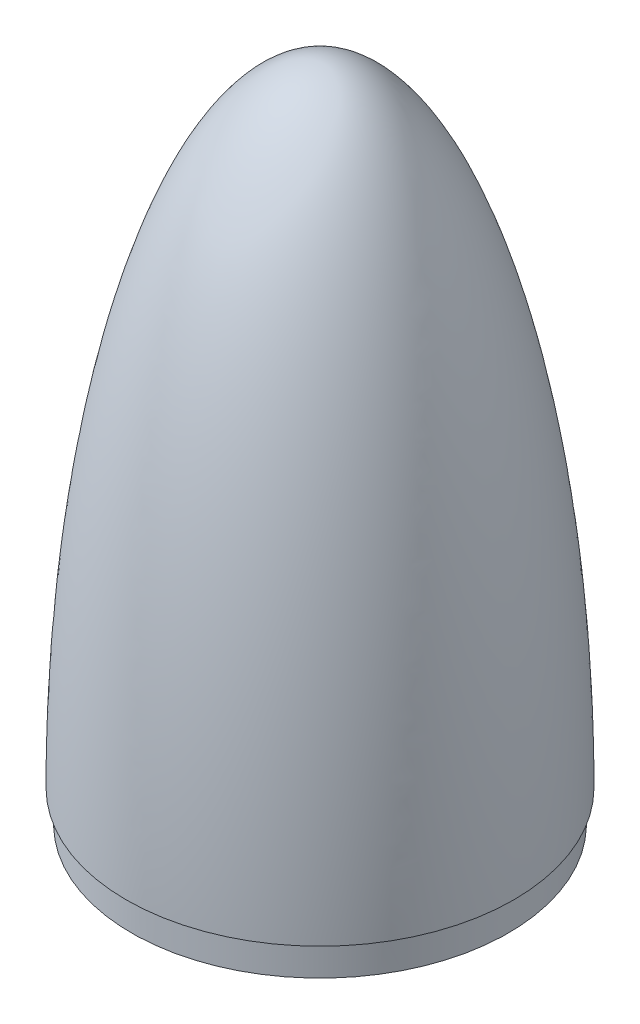
ISO-10303-21;
HEADER;
FILE_DESCRIPTION(('STEP AP214'),'2;1');
FILE_NAME('part.step','',(''),(''),'','','');
FILE_SCHEMA(('AUTOMOTIVE_DESIGN { 1 0 10303 214 1 1 1 1 }'));
ENDSEC;
DATA;
#1=APPLICATION_CONTEXT('core data for automotive mechanical design processes');
#2=APPLICATION_PROTOCOL_DEFINITION('international standard','automotive_design',2000,#1);
#3=PRODUCT_CONTEXT('',#1,'mechanical');
#4=PRODUCT('Part','Part','',(#3));
#5=PRODUCT_RELATED_PRODUCT_CATEGORY('part','',(#4));
#6=PRODUCT_DEFINITION_FORMATION('','',#4);
#7=PRODUCT_DEFINITION_CONTEXT('part definition',#1,'design');
#8=PRODUCT_DEFINITION('design','',#6,#7);
#9=PRODUCT_DEFINITION_SHAPE('','',#8);
#10=(LENGTH_UNIT() NAMED_UNIT(*) SI_UNIT(.MILLI.,.METRE.));
#11=(NAMED_UNIT(*) PLANE_ANGLE_UNIT() SI_UNIT($,.RADIAN.));
#12=(NAMED_UNIT(*) SI_UNIT($,.STERADIAN.) SOLID_ANGLE_UNIT());
#13=UNCERTAINTY_MEASURE_WITH_UNIT(LENGTH_MEASURE(1.E-05),#10,'distance_accuracy_value','');
#14=(GEOMETRIC_REPRESENTATION_CONTEXT(3) GLOBAL_UNCERTAINTY_ASSIGNED_CONTEXT((#13)) GLOBAL_UNIT_ASSIGNED_CONTEXT((#10,
#11,#12)) REPRESENTATION_CONTEXT('',''));
#15=CARTESIAN_POINT('',(0.,0.,0.));
#16=DIRECTION('',(0.,0.,1.));
#17=DIRECTION('',(1.,0.,0.));
#18=AXIS2_PLACEMENT_3D('',#15,#16,#17);
#19=CARTESIAN_POINT('',(5.35625942877467E-13,254.002000000112,0.));
#20=DIRECTION('',(0.,-1.,0.));
#21=DIRECTION('',(0.,0.,-1.));
#22=AXIS2_PLACEMENT_3D('',#19,#20,#21);
#23=CYLINDRICAL_SURFACE('',#22,12.6999999999741);
#24=CARTESIAN_POINT('',(5.35625942877467E-13,225.679493583166,0.));
#25=DIRECTION('',(0.,-1.,0.));
#26=DIRECTION('',(1.,0.,0.));
#27=AXIS2_PLACEMENT_3D('',#24,#25,#26);
#28=CIRCLE('',#27,12.6999999999741);
#29=CARTESIAN_POINT('',(12.6999999999747,225.679493583166,0.));
#30=VERTEX_POINT('',#29);
#31=EDGE_CURVE('E55',#30,#30,#28,.T.);
#32=ORIENTED_EDGE('',*,*,#31,.T.);
#33=EDGE_LOOP('',(#32));
#34=FACE_BOUND('',#33,.T.);
#35=CARTESIAN_POINT('',(5.35625942877467E-13,7.61999999999999,0.));
#36=DIRECTION('',(0.,-1.,0.));
#37=DIRECTION('',(0.,0.,-1.));
#38=AXIS2_PLACEMENT_3D('',#35,#36,#37);
#39=CIRCLE('',#38,12.6999999999741);
#40=CARTESIAN_POINT('',(5.35625942877467E-13,7.61999999999999,-12.6999999999741));
#41=VERTEX_POINT('',#40);
#42=EDGE_CURVE('E97',#41,#41,#39,.F.);
#43=ORIENTED_EDGE('',*,*,#42,.T.);
#44=EDGE_LOOP('',(#43));
#45=FACE_BOUND('',#44,.T.);
#46=ADVANCED_FACE('F46',(#34,#45),#23,.T.);
#47=CARTESIAN_POINT('',(0.,0.,0.));
#48=DIRECTION('',(0.,-1.,0.));
#49=DIRECTION('',(0.,0.,-1.));
#50=AXIS2_PLACEMENT_3D('',#47,#48,#49);
#51=PLANE('',#50);
#52=CARTESIAN_POINT('',(5.35625942877467E-13,0.,0.));
#53=DIRECTION('',(0.,-1.,0.));
#54=DIRECTION('',(0.,0.,-1.));
#55=AXIS2_PLACEMENT_3D('',#52,#53,#54);
#56=CIRCLE('',#55,20.3199999999741);
#57=CARTESIAN_POINT('',(5.35625942877467E-13,0.,-20.3199999999741));
#58=VERTEX_POINT('',#57);
#59=EDGE_CURVE('E93',#58,#58,#56,.T.);
#60=ORIENTED_EDGE('',*,*,#59,.T.);
#61=EDGE_LOOP('',(#60));
#62=FACE_BOUND('',#61,.T.);
#63=CARTESIAN_POINT('',(-35.9210229,0.,-35.9210229));
#64=DIRECTION('',(0.,-1.,0.));
#65=DIRECTION('',(0.,0.,-1.));
#66=AXIS2_PLACEMENT_3D('',#63,#64,#65);
#67=CIRCLE('',#66,2.6924);
#68=CARTESIAN_POINT('',(-35.9210229,0.,-38.6134229));
#69=VERTEX_POINT('',#68);
#70=EDGE_CURVE('E191',#69,#69,#67,.T.);
#71=ORIENTED_EDGE('',*,*,#70,.T.);
#72=EDGE_LOOP('',(#71));
#73=FACE_BOUND('',#72,.T.);
#74=CARTESIAN_POINT('',(-35.9210229,0.,35.9210229));
#75=DIRECTION('',(0.,-1.,0.));
#76=DIRECTION('',(0.,0.,-1.));
#77=AXIS2_PLACEMENT_3D('',#74,#75,#76);
#78=CIRCLE('',#77,2.6924);
#79=CARTESIAN_POINT('',(-35.9210229,0.,33.2286229));
#80=VERTEX_POINT('',#79);
#81=EDGE_CURVE('E199',#80,#80,#78,.T.);
#82=ORIENTED_EDGE('',*,*,#81,.T.);
#83=EDGE_LOOP('',(#82));
#84=FACE_BOUND('',#83,.T.);
#85=CARTESIAN_POINT('',(35.9210229,0.,35.9210229));
#86=DIRECTION('',(0.,-1.,0.));
#87=DIRECTION('',(0.,0.,-1.));
#88=AXIS2_PLACEMENT_3D('',#85,#86,#87);
#89=CIRCLE('',#88,2.6924);
#90=CARTESIAN_POINT('',(35.9210229,0.,33.2286229));
#91=VERTEX_POINT('',#90);
#92=EDGE_CURVE('E207',#91,#91,#89,.T.);
#93=ORIENTED_EDGE('',*,*,#92,.T.);
#94=EDGE_LOOP('',(#93));
#95=FACE_BOUND('',#94,.T.);
#96=CARTESIAN_POINT('',(35.9210229,0.,-35.9210229));
#97=DIRECTION('',(0.,-1.,0.));
#98=DIRECTION('',(0.,0.,-1.));
#99=AXIS2_PLACEMENT_3D('',#96,#97,#98);
#100=CIRCLE('',#99,2.6924);
#101=CARTESIAN_POINT('',(35.9210229,0.,-38.6134229));
#102=VERTEX_POINT('',#101);
#103=EDGE_CURVE('E156',#102,#102,#100,.T.);
#104=ORIENTED_EDGE('',*,*,#103,.T.);
#105=EDGE_LOOP('',(#104));
#106=FACE_BOUND('',#105,.T.);
#107=CARTESIAN_POINT('',(0.,0.,-37.81298));
#108=DIRECTION('',(0.,-1.,0.));
#109=DIRECTION('',(0.,0.,-1.));
#110=AXIS2_PLACEMENT_3D('',#107,#108,#109);
#111=CIRCLE('',#110,2.6924);
#112=CARTESIAN_POINT('',(0.,0.,-40.50538));
#113=VERTEX_POINT('',#112);
#114=EDGE_CURVE('E78',#113,#113,#111,.T.);
#115=ORIENTED_EDGE('',*,*,#114,.T.);
#116=EDGE_LOOP('',(#115));
#117=FACE_BOUND('',#116,.T.);
#118=CARTESIAN_POINT('',(37.81298,0.,0.));
#119=DIRECTION('',(0.,-1.,0.));
#120=DIRECTION('',(0.,0.,-1.));
#121=AXIS2_PLACEMENT_3D('',#118,#119,#120);
#122=CIRCLE('',#121,2.6924);
#123=CARTESIAN_POINT('',(37.81298,0.,-2.6924));
#124=VERTEX_POINT('',#123);
#125=EDGE_CURVE('E168',#124,#124,#122,.T.);
#126=ORIENTED_EDGE('',*,*,#125,.T.);
#127=EDGE_LOOP('',(#126));
#128=FACE_BOUND('',#127,.T.);
#129=CARTESIAN_POINT('',(0.,0.,37.81298));
#130=DIRECTION('',(0.,-1.,0.));
#131=DIRECTION('',(0.,0.,-1.));
#132=AXIS2_PLACEMENT_3D('',#129,#130,#131);
#133=CIRCLE('',#132,2.6924);
#134=CARTESIAN_POINT('',(0.,0.,35.12058));
#135=VERTEX_POINT('',#134);
#136=EDGE_CURVE('E160',#135,#135,#133,.T.);
#137=ORIENTED_EDGE('',*,*,#136,.T.);
#138=EDGE_LOOP('',(#137));
#139=FACE_BOUND('',#138,.T.);
#140=CARTESIAN_POINT('',(-37.81298,0.,0.));
#141=DIRECTION('',(0.,-1.,0.));
#142=DIRECTION('',(0.,0.,-1.));
#143=AXIS2_PLACEMENT_3D('',#140,#141,#142);
#144=CIRCLE('',#143,2.6924);
#145=CARTESIAN_POINT('',(-37.81298,0.,-2.6924));
#146=VERTEX_POINT('',#145);
#147=EDGE_CURVE('E151',#146,#146,#144,.T.);
#148=ORIENTED_EDGE('',*,*,#147,.T.);
#149=EDGE_LOOP('',(#148));
#150=FACE_BOUND('',#149,.T.);
#151=CARTESIAN_POINT('',(0.,0.,0.));
#152=DIRECTION('',(0.,-1.,0.));
#153=DIRECTION('',(0.,0.,-1.));
#154=AXIS2_PLACEMENT_3D('',#151,#152,#153);
#155=CIRCLE('',#154,58.0028622520508);
#156=CARTESIAN_POINT('',(0.,0.,-58.0028622520508));
#157=VERTEX_POINT('',#156);
#158=EDGE_CURVE('E75',#157,#157,#155,.F.);
#159=ORIENTED_EDGE('',*,*,#158,.T.);
#160=EDGE_LOOP('',(#159));
#161=FACE_BOUND('',#160,.T.);
#162=ADVANCED_FACE('F116',(#62,#73,#84,#95,#106,#117,#128,#139,#150,#161),#51,.F.);
#163=CARTESIAN_POINT('',(78.359,-3.85464200295178E-12,0.));
#164=CARTESIAN_POINT('',(78.359,0.547287489083136,0.));
#165=CARTESIAN_POINT('',(78.3578456020914,1.64956361845834,0.));
#166=CARTESIAN_POINT('',(78.3526507757178,3.58634987512864,0.));
#167=CARTESIAN_POINT('',(78.3387963460281,5.9889345965138,0.));
#168=CARTESIAN_POINT('',(78.3180106719865,8.352211568652,0.));
#169=CARTESIAN_POINT('',(78.2902889503954,10.7456008880773,0.));
#170=CARTESIAN_POINT('',(78.246958697056,13.7314118256739,0.));
#171=CARTESIAN_POINT('',(78.1810613065712,17.3117033816343,0.));
#172=CARTESIAN_POINT('',(78.0838662599076,21.4904424666729,0.));
#173=CARTESIAN_POINT('',(77.9448220852114,26.2641170071503,0.));
#174=CARTESIAN_POINT('',(77.7776831858622,31.0375576312102,0.));
#175=CARTESIAN_POINT('',(77.5822913396883,35.8095574562448,0.));
#176=CARTESIAN_POINT('',(77.3584604389541,40.5805118631997,0.));
#177=CARTESIAN_POINT('',(77.0428534871404,46.542286245692,0.));
#178=CARTESIAN_POINT('',(76.679080298482,52.5014361436299,0.));
#179=CARTESIAN_POINT('',(76.2664485683162,58.4573591267391,0.));
#180=CARTESIAN_POINT('',(75.8041028056292,64.4096073987465,0.));
#181=CARTESIAN_POINT('',(75.4040152278983,69.1689496369026,0.));
#182=CARTESIAN_POINT('',(74.8656269280594,75.1147987013107,0.));
#183=CARTESIAN_POINT('',(74.1573857441951,82.2439739931525,0.));
#184=CARTESIAN_POINT('',(73.2382669176931,90.5517309553488,0.));
#185=CARTESIAN_POINT('',(72.0557405970124,100.030771811049,0.));
#186=CARTESIAN_POINT('',(70.7355289433761,109.491671533626,0.));
#187=CARTESIAN_POINT('',(69.2709291178535,118.931305028392,0.));
#188=CARTESIAN_POINT('',(67.2499969191818,130.699881306243,0.));
#189=CARTESIAN_POINT('',(64.5017329483004,144.763840426758,0.));
#190=CARTESIAN_POINT('',(61.308555538234,158.735984092286,0.));
#191=CARTESIAN_POINT('',(57.5910494958651,172.577213573831,0.));
#192=CARTESIAN_POINT('',(53.3830259383035,186.275905478612,0.));
#193=CARTESIAN_POINT('',(49.2387463120402,198.044837448649,0.));
#194=CARTESIAN_POINT('',(44.4832374304626,209.587335711023,0.));
#195=CARTESIAN_POINT('',(38.9428842352643,220.719241790272,0.));
#196=CARTESIAN_POINT('',(34.256173134855,228.693595393195,0.));
#197=CARTESIAN_POINT('',(29.8187102480322,235.095423042067,0.));
#198=CARTESIAN_POINT('',(25.6242497322616,240.182852142934,0.));
#199=CARTESIAN_POINT('',(21.9788928349695,243.926180276473,0.));
#200=CARTESIAN_POINT('',(18.5701501967582,246.859542722743,0.));
#201=CARTESIAN_POINT('',(15.4743490805522,249.076247660669,0.));
#202=CARTESIAN_POINT('',(12.5634057109101,250.785701438392,0.));
#203=CARTESIAN_POINT('',(9.77232736304582,252.083533870556,0.));
#204=CARTESIAN_POINT('',(7.06306970862829,253.028642362432,0.));
#205=CARTESIAN_POINT('',(4.27607752865587,253.686612341416,0.));
#206=CARTESIAN_POINT('',(2.18944383366514,253.939716902274,0.));
#207=CARTESIAN_POINT('',(0.769335111202898,253.999825066912,0.));
#208=CARTESIAN_POINT('',(0.00289059060478085,253.99999951395,0.));
#209=B_SPLINE_CURVE_WITH_KNOTS('',4,(#163,#164,#165,#166,#167,#168,#169,#170,#171,#172,#173,
#174,#175,#176,#177,#178,#179,#180,#181,#182,#183,#184,#185,#186,#187,#188,#189,#190,#191,#192,
#193,#194,#195,#196,#197,#198,#199,#200,#201,#202,#203,#204,#205,#206,#207,#208),.UNSPECIFIED.,
.F.,.F.,(5,1,1,1,1,1,1,1,1,1,1,1,1,1,1,1,1,1,1,1,1,1,1,1,1,1,1,1,1,1,1,1,1,1,1,1,1,1,1,1,1,1,5),
(0.0832901678974378,0.0911196738198312,0.0989491797422246,0.106778685664618,0.114608191587011,
0.122437697509405,0.130267203431798,0.145926215276585,0.161585227308661,0.177244239340738,
0.192903251372814,0.208562263404891,0.22422127500536,0.23988028660583,0.271198309806769,
0.286857322025267,0.302516334243765,0.318175346462263,0.333834358680761,0.365152382658847,
0.396470406636932,0.427788430031848,0.459106453426764,0.490424474288177,0.52174249514959,
0.584378539310645,0.64701458132928,0.678332609009811,0.709650636690343,0.772286631173186,
0.810589211116004,0.841907031493423,0.87260750281029,0.893486158308834,0.912628449807464,
0.928287273750051,0.941044947751305,0.952387223266141,0.962498308196118,0.972496120469674,
0.981348672389275,0.98994985578346,0.999990533103457),.UNSPECIFIED.);
#210=CARTESIAN_POINT('',(0.,254.000000000112,0.));
#211=DIRECTION('',(0.,1.,0.));
#212=AXIS1_PLACEMENT('',#210,#211);
#213=SURFACE_OF_REVOLUTION('',#209,#212);
#214=OFFSET_SURFACE('',#213,-12.7,.F.);
#215=CARTESIAN_POINT('',(0.,230.488876594818,0.));
#216=DIRECTION('',(0.,1.,0.));
#217=DIRECTION('',(-1.,0.,0.));
#218=AXIS2_PLACEMENT_3D('',#215,#216,#217);
#219=CIRCLE('',#218,17.0965042952224);
#220=CARTESIAN_POINT('',(-17.0965042952224,230.488876594818,0.));
#221=VERTEX_POINT('',#220);
#222=EDGE_CURVE('E11',#221,#221,#219,.T.);
#223=ORIENTED_EDGE('',*,*,#222,.T.);
#224=EDGE_LOOP('',(#223));
#225=FACE_BOUND('',#224,.T.);
#226=CARTESIAN_POINT('',(0.,7.69269344902174,0.));
#227=DIRECTION('',(0.,1.,0.));
#228=DIRECTION('',(-1.,0.,0.));
#229=AXIS2_PLACEMENT_3D('',#226,#227,#228);
#230=CIRCLE('',#229,65.6225155028535);
#231=CARTESIAN_POINT('',(-65.6225155028535,7.69269344902174,0.));
#232=VERTEX_POINT('',#231);
#233=EDGE_CURVE('E89',#232,#232,#230,.F.);
#234=ORIENTED_EDGE('',*,*,#233,.T.);
#235=EDGE_LOOP('',(#234));
#236=FACE_BOUND('',#235,.T.);
#237=ADVANCED_FACE('F123',(#225,#236),#214,.F.);
#238=CARTESIAN_POINT('',(0.,7.61999999999927,0.));
#239=DIRECTION('',(0.,1.,0.));
#240=DIRECTION('',(-1.,0.,0.));
#241=AXIS2_PLACEMENT_3D('',#238,#239,#240);
#242=TOROIDAL_SURFACE('',#241,58.0028622520508,7.62);
#243=ORIENTED_EDGE('',*,*,#233,.F.);
#244=EDGE_LOOP('',(#243));
#245=FACE_BOUND('',#244,.T.);
#246=ORIENTED_EDGE('',*,*,#158,.F.);
#247=EDGE_LOOP('',(#246));
#248=FACE_BOUND('',#247,.T.);
#249=ADVANCED_FACE('F140',(#245,#248),#242,.F.);
#250=CARTESIAN_POINT('',(-37.81298,0.,0.));
#251=DIRECTION('',(0.,-1.,0.));
#252=DIRECTION('',(0.,0.,-1.));
#253=AXIS2_PLACEMENT_3D('',#250,#251,#252);
#254=CYLINDRICAL_SURFACE('',#253,2.6924);
#255=ORIENTED_EDGE('',*,*,#147,.F.);
#256=EDGE_LOOP('',(#255));
#257=FACE_BOUND('',#256,.T.);
#258=CARTESIAN_POINT('',(-37.81298,-12.7,0.));
#259=DIRECTION('',(0.,-1.,0.));
#260=DIRECTION('',(0.,0.,-1.));
#261=AXIS2_PLACEMENT_3D('',#258,#259,#260);
#262=CIRCLE('',#261,2.6924);
#263=CARTESIAN_POINT('',(-37.81298,-12.7,-2.6924));
#264=VERTEX_POINT('',#263);
#265=EDGE_CURVE('E155',#264,#264,#262,.T.);
#266=ORIENTED_EDGE('',*,*,#265,.T.);
#267=EDGE_LOOP('',(#266));
#268=FACE_BOUND('',#267,.T.);
#269=ADVANCED_FACE('F128',(#257,#268),#254,.F.);
#270=CARTESIAN_POINT('',(0.,0.,37.81298));
#271=DIRECTION('',(0.,-1.,0.));
#272=DIRECTION('',(0.,0.,-1.));
#273=AXIS2_PLACEMENT_3D('',#270,#271,#272);
#274=CYLINDRICAL_SURFACE('',#273,2.6924);
#275=ORIENTED_EDGE('',*,*,#136,.F.);
#276=EDGE_LOOP('',(#275));
#277=FACE_BOUND('',#276,.T.);
#278=CARTESIAN_POINT('',(0.,-12.7,37.81298));
#279=DIRECTION('',(0.,-1.,0.));
#280=DIRECTION('',(0.,0.,-1.));
#281=AXIS2_PLACEMENT_3D('',#278,#279,#280);
#282=CIRCLE('',#281,2.6924);
#283=CARTESIAN_POINT('',(0.,-12.7,35.12058));
#284=VERTEX_POINT('',#283);
#285=EDGE_CURVE('E164',#284,#284,#282,.T.);
#286=ORIENTED_EDGE('',*,*,#285,.T.);
#287=EDGE_LOOP('',(#286));
#288=FACE_BOUND('',#287,.T.);
#289=ADVANCED_FACE('F312',(#277,#288),#274,.F.);
#290=CARTESIAN_POINT('',(37.81298,0.,0.));
#291=DIRECTION('',(0.,-1.,0.));
#292=DIRECTION('',(0.,0.,-1.));
#293=AXIS2_PLACEMENT_3D('',#290,#291,#292);
#294=CYLINDRICAL_SURFACE('',#293,2.6924);
#295=ORIENTED_EDGE('',*,*,#125,.F.);
#296=EDGE_LOOP('',(#295));
#297=FACE_BOUND('',#296,.T.);
#298=CARTESIAN_POINT('',(37.81298,-12.7,0.));
#299=DIRECTION('',(0.,-1.,0.));
#300=DIRECTION('',(0.,0.,-1.));
#301=AXIS2_PLACEMENT_3D('',#298,#299,#300);
#302=CIRCLE('',#301,2.6924);
#303=CARTESIAN_POINT('',(37.81298,-12.7,-2.6924));
#304=VERTEX_POINT('',#303);
#305=EDGE_CURVE('E172',#304,#304,#302,.T.);
#306=ORIENTED_EDGE('',*,*,#305,.T.);
#307=EDGE_LOOP('',(#306));
#308=FACE_BOUND('',#307,.T.);
#309=ADVANCED_FACE('F319',(#297,#308),#294,.F.);
#310=CARTESIAN_POINT('',(0.,0.,-37.81298));
#311=DIRECTION('',(0.,-1.,0.));
#312=DIRECTION('',(0.,0.,-1.));
#313=AXIS2_PLACEMENT_3D('',#310,#311,#312);
#314=CYLINDRICAL_SURFACE('',#313,2.6924);
#315=ORIENTED_EDGE('',*,*,#114,.F.);
#316=EDGE_LOOP('',(#315));
#317=FACE_BOUND('',#316,.T.);
#318=CARTESIAN_POINT('',(0.,-12.7,-37.81298));
#319=DIRECTION('',(0.,-1.,0.));
#320=DIRECTION('',(0.,0.,-1.));
#321=AXIS2_PLACEMENT_3D('',#318,#319,#320);
#322=CIRCLE('',#321,2.6924);
#323=CARTESIAN_POINT('',(0.,-12.7,-40.50538));
#324=VERTEX_POINT('',#323);
#325=EDGE_CURVE('E176',#324,#324,#322,.T.);
#326=ORIENTED_EDGE('',*,*,#325,.T.);
#327=EDGE_LOOP('',(#326));
#328=FACE_BOUND('',#327,.T.);
#329=ADVANCED_FACE('F62',(#317,#328),#314,.F.);
#330=CARTESIAN_POINT('',(78.359,-3.85464200295178E-12,0.));
#331=CARTESIAN_POINT('',(78.359,0.547287489083136,0.));
#332=CARTESIAN_POINT('',(78.3578456020914,1.64956361845834,0.));
#333=CARTESIAN_POINT('',(78.3526507757178,3.58634987512864,0.));
#334=CARTESIAN_POINT('',(78.3387963460281,5.9889345965138,0.));
#335=CARTESIAN_POINT('',(78.3180106719865,8.352211568652,0.));
#336=CARTESIAN_POINT('',(78.2902889503954,10.7456008880773,0.));
#337=CARTESIAN_POINT('',(78.246958697056,13.7314118256739,0.));
#338=CARTESIAN_POINT('',(78.1810613065712,17.3117033816343,0.));
#339=CARTESIAN_POINT('',(78.0838662599076,21.4904424666729,0.));
#340=CARTESIAN_POINT('',(77.9448220852114,26.2641170071503,0.));
#341=CARTESIAN_POINT('',(77.7776831858622,31.0375576312102,0.));
#342=CARTESIAN_POINT('',(77.5822913396883,35.8095574562448,0.));
#343=CARTESIAN_POINT('',(77.3584604389541,40.5805118631997,0.));
#344=CARTESIAN_POINT('',(77.0428534871404,46.542286245692,0.));
#345=CARTESIAN_POINT('',(76.679080298482,52.5014361436299,0.));
#346=CARTESIAN_POINT('',(76.2664485683162,58.4573591267391,0.));
#347=CARTESIAN_POINT('',(75.8041028056292,64.4096073987465,0.));
#348=CARTESIAN_POINT('',(75.4040152278983,69.1689496369026,0.));
#349=CARTESIAN_POINT('',(74.8656269280594,75.1147987013107,0.));
#350=CARTESIAN_POINT('',(74.1573857441951,82.2439739931525,0.));
#351=CARTESIAN_POINT('',(73.2382669176931,90.5517309553488,0.));
#352=CARTESIAN_POINT('',(72.0557405970124,100.030771811049,0.));
#353=CARTESIAN_POINT('',(70.7355289433761,109.491671533626,0.));
#354=CARTESIAN_POINT('',(69.2709291178535,118.931305028392,0.));
#355=CARTESIAN_POINT('',(67.2499969191818,130.699881306243,0.));
#356=CARTESIAN_POINT('',(64.5017329483004,144.763840426758,0.));
#357=CARTESIAN_POINT('',(61.308555538234,158.735984092286,0.));
#358=CARTESIAN_POINT('',(57.5910494958651,172.577213573831,0.));
#359=CARTESIAN_POINT('',(53.3830259383035,186.275905478612,0.));
#360=CARTESIAN_POINT('',(49.2387463120402,198.044837448649,0.));
#361=CARTESIAN_POINT('',(44.4832374304626,209.587335711023,0.));
#362=CARTESIAN_POINT('',(38.9428842352643,220.719241790272,0.));
#363=CARTESIAN_POINT('',(34.256173134855,228.693595393195,0.));
#364=CARTESIAN_POINT('',(29.8187102480322,235.095423042067,0.));
#365=CARTESIAN_POINT('',(25.6242497322616,240.182852142934,0.));
#366=CARTESIAN_POINT('',(21.9788928349695,243.926180276473,0.));
#367=CARTESIAN_POINT('',(18.5701501967582,246.859542722743,0.));
#368=CARTESIAN_POINT('',(15.4743490805522,249.076247660669,0.));
#369=CARTESIAN_POINT('',(12.5634057109101,250.785701438392,0.));
#370=CARTESIAN_POINT('',(9.77232736304582,252.083533870556,0.));
#371=CARTESIAN_POINT('',(7.06306970862829,253.028642362432,0.));
#372=CARTESIAN_POINT('',(4.27537380497185,253.686778480762,0.));
#373=CARTESIAN_POINT('',(2.18800688606537,253.939891173376,0.));
#374=CARTESIAN_POINT('',(0.767171585554643,253.999916554836,0.));
#375=CARTESIAN_POINT('',(0.,254.000000000112,0.));
#376=B_SPLINE_CURVE_WITH_KNOTS('',4,(#330,#331,#332,#333,#334,#335,#336,#337,#338,#339,#340,
#341,#342,#343,#344,#345,#346,#347,#348,#349,#350,#351,#352,#353,#354,#355,#356,#357,#358,#359,
#360,#361,#362,#363,#364,#365,#366,#367,#368,#369,#370,#371,#372,#373,#374,#375),.UNSPECIFIED.,
.F.,.F.,(5,1,1,1,1,1,1,1,1,1,1,1,1,1,1,1,1,1,1,1,1,1,1,1,1,1,1,1,1,1,1,1,1,1,1,1,1,1,1,1,1,1,5),
(0.0832901678974378,0.0911196738198312,0.0989491797422246,0.106778685664618,0.114608191587011,
0.122437697509405,0.130267203431798,0.145926215276585,0.161585227308661,0.177244239340738,
0.192903251372814,0.208562263404891,0.22422127500536,0.23988028660583,0.271198309806769,
0.286857322025267,0.302516334243765,0.318175346462263,0.333834358680761,0.365152382658847,
0.396470406636932,0.427788430031848,0.459106453426764,0.490424474288177,0.52174249514959,
0.584378539310645,0.64701458132928,0.678332609009811,0.709650636690343,0.772286631173186,
0.810589211116004,0.841907031493423,0.87260750281029,0.893486158308834,0.912628449807464,
0.928287273750051,0.941044947751305,0.952387223266141,0.962498308196118,0.972496120469674,
0.981348672389275,0.98994985578346,1.),.UNSPECIFIED.);
#377=CARTESIAN_POINT('',(0.,254.000000000112,0.));
#378=DIRECTION('',(0.,1.,0.));
#379=AXIS1_PLACEMENT('',#377,#378);
#380=SURFACE_OF_REVOLUTION('',#376,#379);
#381=CARTESIAN_POINT('',(0.,254.000000000112,0.));
#382=VERTEX_POINT('',#381);
#383=VERTEX_LOOP('',#382);
#384=FACE_BOUND('',#383,.T.);
#385=CARTESIAN_POINT('',(0.,0.,0.));
#386=DIRECTION('',(0.,1.,0.));
#387=DIRECTION('',(-1.,0.,0.));
#388=AXIS2_PLACEMENT_3D('',#385,#386,#387);
#389=CIRCLE('',#388,78.359);
#390=CARTESIAN_POINT('',(-78.359,0.,0.));
#391=VERTEX_POINT('',#390);
#392=EDGE_CURVE('E66',#391,#391,#389,.T.);
#393=ORIENTED_EDGE('',*,*,#392,.T.);
#394=EDGE_LOOP('',(#393));
#395=FACE_BOUND('',#394,.T.);
#396=ADVANCED_FACE('F58',(#384,#395),#380,.T.);
#397=CARTESIAN_POINT('',(78.359,0.,0.));
#398=DIRECTION('',(0.,1.,0.));
#399=DIRECTION('',(-1.,0.,0.));
#400=AXIS2_PLACEMENT_3D('',#397,#398,#399);
#401=PLANE('',#400);
#402=CARTESIAN_POINT('',(0.,0.,0.));
#403=DIRECTION('',(0.,1.,0.));
#404=DIRECTION('',(-1.,0.,0.));
#405=AXIS2_PLACEMENT_3D('',#402,#403,#404);
#406=CIRCLE('',#405,76.2);
#407=CARTESIAN_POINT('',(-76.2,0.,0.));
#408=VERTEX_POINT('',#407);
#409=EDGE_CURVE('E69',#408,#408,#406,.F.);
#410=ORIENTED_EDGE('',*,*,#409,.F.);
#411=EDGE_LOOP('',(#410));
#412=FACE_BOUND('',#411,.T.);
#413=ORIENTED_EDGE('',*,*,#392,.F.);
#414=EDGE_LOOP('',(#413));
#415=FACE_BOUND('',#414,.T.);
#416=ADVANCED_FACE('F61',(#412,#415),#401,.F.);
#417=CARTESIAN_POINT('',(0.,-12.7,0.));
#418=DIRECTION('',(0.,1.,0.));
#419=DIRECTION('',(0.,0.,1.));
#420=AXIS2_PLACEMENT_3D('',#417,#418,#419);
#421=CYLINDRICAL_SURFACE('',#420,76.2);
#422=CARTESIAN_POINT('',(0.,-12.7,0.));
#423=DIRECTION('',(0.,-1.,0.));
#424=DIRECTION('',(0.,0.,-1.));
#425=AXIS2_PLACEMENT_3D('',#422,#423,#424);
#426=CIRCLE('',#425,76.2);
#427=CARTESIAN_POINT('',(0.,-12.7,-76.2));
#428=VERTEX_POINT('',#427);
#429=EDGE_CURVE('E70',#428,#428,#426,.T.);
#430=ORIENTED_EDGE('',*,*,#429,.F.);
#431=EDGE_LOOP('',(#430));
#432=FACE_BOUND('',#431,.T.);
#433=ORIENTED_EDGE('',*,*,#409,.T.);
#434=EDGE_LOOP('',(#433));
#435=FACE_BOUND('',#434,.T.);
#436=ADVANCED_FACE('F133',(#432,#435),#421,.T.);
#437=CARTESIAN_POINT('',(0.,-12.7,0.));
#438=DIRECTION('',(0.,-1.,0.));
#439=DIRECTION('',(0.,0.,-1.));
#440=AXIS2_PLACEMENT_3D('',#437,#438,#439);
#441=PLANE('',#440);
#442=CARTESIAN_POINT('',(-35.9210229,-12.7,-35.9210229));
#443=DIRECTION('',(0.,-1.,0.));
#444=DIRECTION('',(0.,0.,-1.));
#445=AXIS2_PLACEMENT_3D('',#442,#443,#444);
#446=CIRCLE('',#445,2.6924);
#447=CARTESIAN_POINT('',(-35.9210229,-12.7,-38.6134229));
#448=VERTEX_POINT('',#447);
#449=EDGE_CURVE('E195',#448,#448,#446,.T.);
#450=ORIENTED_EDGE('',*,*,#449,.F.);
#451=EDGE_LOOP('',(#450));
#452=FACE_BOUND('',#451,.T.);
#453=CARTESIAN_POINT('',(-35.9210229,-12.7,35.9210229));
#454=DIRECTION('',(0.,-1.,0.));
#455=DIRECTION('',(0.,0.,-1.));
#456=AXIS2_PLACEMENT_3D('',#453,#454,#455);
#457=CIRCLE('',#456,2.6924);
#458=CARTESIAN_POINT('',(-35.9210229,-12.7,33.2286229));
#459=VERTEX_POINT('',#458);
#460=EDGE_CURVE('E203',#459,#459,#457,.T.);
#461=ORIENTED_EDGE('',*,*,#460,.F.);
#462=EDGE_LOOP('',(#461));
#463=FACE_BOUND('',#462,.T.);
#464=CARTESIAN_POINT('',(35.9210229,-12.7,35.9210229));
#465=DIRECTION('',(0.,-1.,0.));
#466=DIRECTION('',(0.,0.,-1.));
#467=AXIS2_PLACEMENT_3D('',#464,#465,#466);
#468=CIRCLE('',#467,2.6924);
#469=CARTESIAN_POINT('',(35.9210229,-12.7,33.2286229));
#470=VERTEX_POINT('',#469);
#471=EDGE_CURVE('E187',#470,#470,#468,.T.);
#472=ORIENTED_EDGE('',*,*,#471,.F.);
#473=EDGE_LOOP('',(#472));
#474=FACE_BOUND('',#473,.T.);
#475=CARTESIAN_POINT('',(35.9210229,-12.7,-35.9210229));
#476=DIRECTION('',(0.,-1.,0.));
#477=DIRECTION('',(0.,0.,-1.));
#478=AXIS2_PLACEMENT_3D('',#475,#476,#477);
#479=CIRCLE('',#478,2.6924);
#480=CARTESIAN_POINT('',(35.9210229,-12.7,-38.6134229));
#481=VERTEX_POINT('',#480);
#482=EDGE_CURVE('E183',#481,#481,#479,.T.);
#483=ORIENTED_EDGE('',*,*,#482,.F.);
#484=EDGE_LOOP('',(#483));
#485=FACE_BOUND('',#484,.T.);
#486=ORIENTED_EDGE('',*,*,#325,.F.);
#487=EDGE_LOOP('',(#486));
#488=FACE_BOUND('',#487,.T.);
#489=ORIENTED_EDGE('',*,*,#305,.F.);
#490=EDGE_LOOP('',(#489));
#491=FACE_BOUND('',#490,.T.);
#492=ORIENTED_EDGE('',*,*,#285,.F.);
#493=EDGE_LOOP('',(#492));
#494=FACE_BOUND('',#493,.T.);
#495=ORIENTED_EDGE('',*,*,#265,.F.);
#496=EDGE_LOOP('',(#495));
#497=FACE_BOUND('',#496,.T.);
#498=ORIENTED_EDGE('',*,*,#429,.T.);
#499=EDGE_LOOP('',(#498));
#500=FACE_BOUND('',#499,.T.);
#501=ADVANCED_FACE('F130',(#452,#463,#474,#485,#488,#491,#494,#497,#500),#441,.T.);
#502=CARTESIAN_POINT('',(35.9210229,0.,-35.9210229));
#503=DIRECTION('',(0.,-1.,0.));
#504=DIRECTION('',(0.,0.,-1.));
#505=AXIS2_PLACEMENT_3D('',#502,#503,#504);
#506=CYLINDRICAL_SURFACE('',#505,2.6924);
#507=ORIENTED_EDGE('',*,*,#103,.F.);
#508=EDGE_LOOP('',(#507));
#509=FACE_BOUND('',#508,.T.);
#510=ORIENTED_EDGE('',*,*,#482,.T.);
#511=EDGE_LOOP('',(#510));
#512=FACE_BOUND('',#511,.T.);
#513=ADVANCED_FACE('F132',(#509,#512),#506,.F.);
#514=CARTESIAN_POINT('',(35.9210229,0.,35.9210229));
#515=DIRECTION('',(0.,-1.,0.));
#516=DIRECTION('',(0.,0.,-1.));
#517=AXIS2_PLACEMENT_3D('',#514,#515,#516);
#518=CYLINDRICAL_SURFACE('',#517,2.6924);
#519=ORIENTED_EDGE('',*,*,#92,.F.);
#520=EDGE_LOOP('',(#519));
#521=FACE_BOUND('',#520,.T.);
#522=ORIENTED_EDGE('',*,*,#471,.T.);
#523=EDGE_LOOP('',(#522));
#524=FACE_BOUND('',#523,.T.);
#525=ADVANCED_FACE('F215',(#521,#524),#518,.F.);
#526=CARTESIAN_POINT('',(-35.9210229,0.,35.9210229));
#527=DIRECTION('',(0.,-1.,0.));
#528=DIRECTION('',(0.,0.,-1.));
#529=AXIS2_PLACEMENT_3D('',#526,#527,#528);
#530=CYLINDRICAL_SURFACE('',#529,2.6924);
#531=ORIENTED_EDGE('',*,*,#81,.F.);
#532=EDGE_LOOP('',(#531));
#533=FACE_BOUND('',#532,.T.);
#534=ORIENTED_EDGE('',*,*,#460,.T.);
#535=EDGE_LOOP('',(#534));
#536=FACE_BOUND('',#535,.T.);
#537=ADVANCED_FACE('F261',(#533,#536),#530,.F.);
#538=CARTESIAN_POINT('',(-35.9210229,0.,-35.9210229));
#539=DIRECTION('',(0.,-1.,0.));
#540=DIRECTION('',(0.,0.,-1.));
#541=AXIS2_PLACEMENT_3D('',#538,#539,#540);
#542=CYLINDRICAL_SURFACE('',#541,2.6924);
#543=ORIENTED_EDGE('',*,*,#70,.F.);
#544=EDGE_LOOP('',(#543));
#545=FACE_BOUND('',#544,.T.);
#546=ORIENTED_EDGE('',*,*,#449,.T.);
#547=EDGE_LOOP('',(#546));
#548=FACE_BOUND('',#547,.T.);
#549=ADVANCED_FACE('F112',(#545,#548),#542,.F.);
#550=CARTESIAN_POINT('',(5.35625942877467E-13,7.61999999999999,0.));
#551=DIRECTION('',(0.,-1.,0.));
#552=DIRECTION('',(0.,0.,-1.));
#553=AXIS2_PLACEMENT_3D('',#550,#551,#552);
#554=TOROIDAL_SURFACE('',#553,20.3199999999741,7.62);
#555=ORIENTED_EDGE('',*,*,#42,.F.);
#556=EDGE_LOOP('',(#555));
#557=FACE_BOUND('',#556,.T.);
#558=ORIENTED_EDGE('',*,*,#59,.F.);
#559=EDGE_LOOP('',(#558));
#560=FACE_BOUND('',#559,.T.);
#561=ADVANCED_FACE('F107',(#557,#560),#554,.F.);
#562=CARTESIAN_POINT('',(0.,225.679493583168,0.));
#563=DIRECTION('',(0.,1.,0.));
#564=DIRECTION('',(-1.,0.,0.));
#565=AXIS2_PLACEMENT_3D('',#562,#563,#564);
#566=CONICAL_SURFACE('',#565,12.6999999999746,0.740578777156634);
#567=ORIENTED_EDGE('',*,*,#222,.F.);
#568=EDGE_LOOP('',(#567));
#569=FACE_BOUND('',#568,.T.);
#570=ORIENTED_EDGE('',*,*,#31,.F.);
#571=EDGE_LOOP('',(#570));
#572=FACE_BOUND('',#571,.T.);
#573=ADVANCED_FACE('F49',(#569,#572),#566,.T.);
#574=CLOSED_SHELL('',(#46,#162,#237,#249,#269,#289,#309,#329,#396,#416,#436,#501,#513,#525,#537,
#549,#561,#573));
#575=MANIFOLD_SOLID_BREP('B2',#574);
#576=ADVANCED_BREP_SHAPE_REPRESENTATION('',(#18,#575),#14);
#577=SHAPE_DEFINITION_REPRESENTATION(#9,#576);
ENDSEC;
END-ISO-10303-21;
